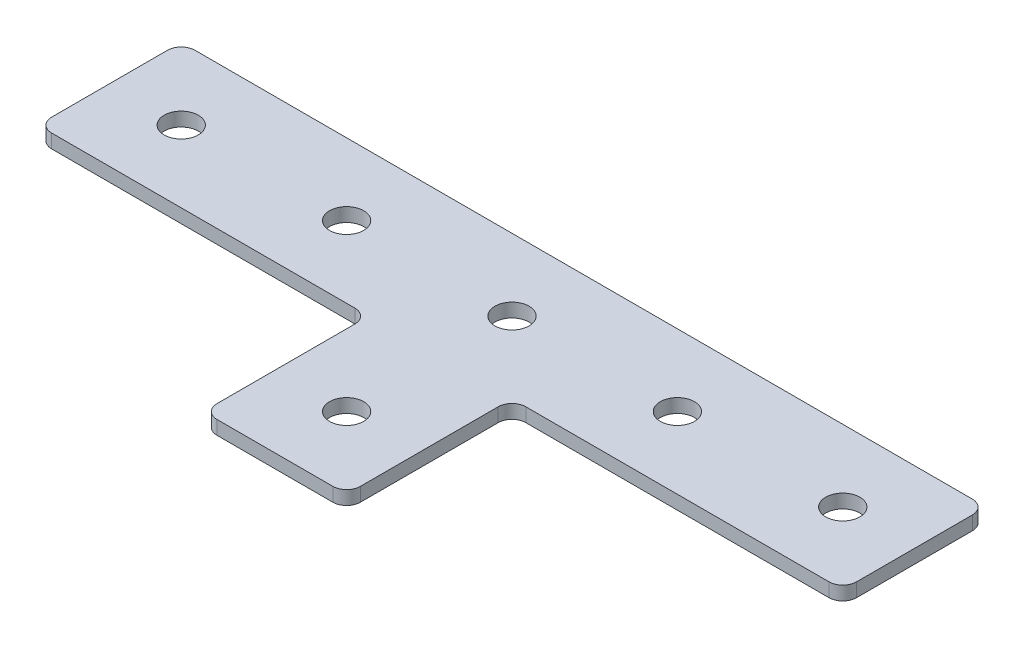
ISO-10303-21;
HEADER;
FILE_DESCRIPTION(('STEP AP214'),'2;1');
FILE_NAME('part.step','',(''),(''),'','','');
FILE_SCHEMA(('AUTOMOTIVE_DESIGN { 1 0 10303 214 1 1 1 1 }'));
ENDSEC;
DATA;
#1=APPLICATION_CONTEXT('core data for automotive mechanical design processes');
#2=APPLICATION_PROTOCOL_DEFINITION('international standard','automotive_design',2000,#1);
#3=PRODUCT_CONTEXT('',#1,'mechanical');
#4=PRODUCT('Part','Part','',(#3));
#5=PRODUCT_RELATED_PRODUCT_CATEGORY('part','',(#4));
#6=PRODUCT_DEFINITION_FORMATION('','',#4);
#7=PRODUCT_DEFINITION_CONTEXT('part definition',#1,'design');
#8=PRODUCT_DEFINITION('design','',#6,#7);
#9=PRODUCT_DEFINITION_SHAPE('','',#8);
#10=(LENGTH_UNIT() NAMED_UNIT(*) SI_UNIT(.MILLI.,.METRE.));
#11=(NAMED_UNIT(*) PLANE_ANGLE_UNIT() SI_UNIT($,.RADIAN.));
#12=(NAMED_UNIT(*) SI_UNIT($,.STERADIAN.) SOLID_ANGLE_UNIT());
#13=UNCERTAINTY_MEASURE_WITH_UNIT(LENGTH_MEASURE(1.E-05),#10,'distance_accuracy_value','');
#14=(GEOMETRIC_REPRESENTATION_CONTEXT(3) GLOBAL_UNCERTAINTY_ASSIGNED_CONTEXT((#13)) GLOBAL_UNIT_ASSIGNED_CONTEXT((#10,
#11,#12)) REPRESENTATION_CONTEXT('',''));
#15=CARTESIAN_POINT('',(0.,0.,0.));
#16=DIRECTION('',(0.,0.,1.));
#17=DIRECTION('',(1.,0.,0.));
#18=AXIS2_PLACEMENT_3D('',#15,#16,#17);
#19=CARTESIAN_POINT('',(-1.7997230439164,1.02470932674123,-15.4746166088125));
#20=DIRECTION('',(0.,-1.,0.));
#21=DIRECTION('',(0.,0.,-1.));
#22=AXIS2_PLACEMENT_3D('',#19,#20,#21);
#23=PLANE('',#22);
#24=CARTESIAN_POINT('',(-1.7997230439164,1.02470932674123,-15.4746166088125));
#25=DIRECTION('',(0.,1.,0.));
#26=DIRECTION('',(0.,0.,1.));
#27=AXIS2_PLACEMENT_3D('',#24,#25,#26);
#28=CIRCLE('',#27,3.1);
#29=CARTESIAN_POINT('',(-1.7997230439164,1.02470932674123,-12.3746166088125));
#30=VERTEX_POINT('',#29);
#31=EDGE_CURVE('E276',#30,#30,#28,.T.);
#32=ORIENTED_EDGE('',*,*,#31,.T.);
#33=EDGE_LOOP('',(#32));
#34=FACE_BOUND('',#33,.T.);
#35=DIRECTION('',(0.,0.,-1.));
#36=VECTOR('',#35,1.);
#37=CARTESIAN_POINT('',(11.2002769560837,1.02470932674123,27.5253833911875));
#38=LINE('',#37,#36);
#39=CARTESIAN_POINT('',(11.2002769560837,1.02470932674123,25.0253833911875));
#40=VERTEX_POINT('',#39);
#41=CARTESIAN_POINT('',(11.2002769560837,1.02470932674123,0.025383391187541));
#42=VERTEX_POINT('',#41);
#43=EDGE_CURVE('E158',#40,#42,#38,.T.);
#44=ORIENTED_EDGE('',*,*,#43,.F.);
#45=CARTESIAN_POINT('',(8.70027695608371,1.02470932674123,25.0253833911875));
#46=DIRECTION('',(0.,-1.,0.));
#47=DIRECTION('',(0.,0.,-1.));
#48=AXIS2_PLACEMENT_3D('',#45,#46,#47);
#49=CIRCLE('',#48,2.5);
#50=CARTESIAN_POINT('',(8.70027695608371,1.02470932674123,27.5253833911875));
#51=VERTEX_POINT('',#50);
#52=EDGE_CURVE('E187',#40,#51,#49,.T.);
#53=ORIENTED_EDGE('',*,*,#52,.T.);
#54=DIRECTION('',(1.,0.,0.));
#55=VECTOR('',#54,1.);
#56=CARTESIAN_POINT('',(-14.7997230439165,1.02470932674123,27.5253833911875));
#57=LINE('',#56,#55);
#58=CARTESIAN_POINT('',(-12.2997230439165,1.02470932674123,27.5253833911875));
#59=VERTEX_POINT('',#58);
#60=EDGE_CURVE('E162',#59,#51,#57,.T.);
#61=ORIENTED_EDGE('',*,*,#60,.F.);
#62=CARTESIAN_POINT('',(-12.2997230439165,1.02470932674123,25.0253833911875));
#63=DIRECTION('',(0.,-1.,0.));
#64=DIRECTION('',(0.,0.,-1.));
#65=AXIS2_PLACEMENT_3D('',#62,#63,#64);
#66=CIRCLE('',#65,2.5);
#67=CARTESIAN_POINT('',(-14.7997230439165,1.02470932674123,25.0253833911875));
#68=VERTEX_POINT('',#67);
#69=EDGE_CURVE('E157',#59,#68,#66,.T.);
#70=ORIENTED_EDGE('',*,*,#69,.T.);
#71=DIRECTION('',(0.,0.,-1.));
#72=VECTOR('',#71,1.);
#73=CARTESIAN_POINT('',(-14.7997230439165,1.02470932674123,27.5253833911875));
#74=LINE('',#73,#72);
#75=CARTESIAN_POINT('',(-14.7997230439165,1.02470932674123,0.0253833911875445));
#76=VERTEX_POINT('',#75);
#77=EDGE_CURVE('E240',#68,#76,#74,.T.);
#78=ORIENTED_EDGE('',*,*,#77,.T.);
#79=CARTESIAN_POINT('',(-17.2997230439165,1.02470932674123,0.0253833911875445));
#80=DIRECTION('',(0.,-1.,0.));
#81=DIRECTION('',(0.,0.,-1.));
#82=AXIS2_PLACEMENT_3D('',#79,#80,#81);
#83=CIRCLE('',#82,2.5);
#84=CARTESIAN_POINT('',(-17.2997230439165,1.02470932674123,-2.47461660881246));
#85=VERTEX_POINT('',#84);
#86=EDGE_CURVE('E10',#76,#85,#83,.F.);
#87=ORIENTED_EDGE('',*,*,#86,.T.);
#88=DIRECTION('',(-1.,0.,0.));
#89=VECTOR('',#88,1.);
#90=CARTESIAN_POINT('',(-14.7997230439165,1.02470932674123,-2.47461660881246));
#91=LINE('',#90,#89);
#92=CARTESIAN_POINT('',(-72.2997230439163,1.02470932674123,-2.47461660881244));
#93=VERTEX_POINT('',#92);
#94=EDGE_CURVE('E230',#85,#93,#91,.T.);
#95=ORIENTED_EDGE('',*,*,#94,.T.);
#96=CARTESIAN_POINT('',(-72.2997230439163,1.02470932674123,-4.97461660881244));
#97=DIRECTION('',(0.,-1.,0.));
#98=DIRECTION('',(0.,0.,-1.));
#99=AXIS2_PLACEMENT_3D('',#96,#97,#98);
#100=CIRCLE('',#99,2.5);
#101=CARTESIAN_POINT('',(-74.7997230439163,1.02470932674123,-4.97461660881244));
#102=VERTEX_POINT('',#101);
#103=EDGE_CURVE('E179',#93,#102,#100,.T.);
#104=ORIENTED_EDGE('',*,*,#103,.T.);
#105=DIRECTION('',(0.,0.,-1.));
#106=VECTOR('',#105,1.);
#107=CARTESIAN_POINT('',(-74.7997230439163,1.02470932674123,-2.47461660881244));
#108=LINE('',#107,#106);
#109=CARTESIAN_POINT('',(-74.7997230439163,1.02470932674123,-25.9746166088125));
#110=VERTEX_POINT('',#109);
#111=EDGE_CURVE('E244',#102,#110,#108,.T.);
#112=ORIENTED_EDGE('',*,*,#111,.T.);
#113=CARTESIAN_POINT('',(-72.2997230439163,1.02470932674123,-25.9746166088125));
#114=DIRECTION('',(0.,-1.,0.));
#115=DIRECTION('',(0.,0.,-1.));
#116=AXIS2_PLACEMENT_3D('',#113,#114,#115);
#117=CIRCLE('',#116,2.5);
#118=CARTESIAN_POINT('',(-72.2997230439163,1.02470932674123,-28.4746166088125));
#119=VERTEX_POINT('',#118);
#120=EDGE_CURVE('E182',#110,#119,#117,.T.);
#121=ORIENTED_EDGE('',*,*,#120,.T.);
#122=DIRECTION('',(-1.,0.,0.));
#123=VECTOR('',#122,1.);
#124=CARTESIAN_POINT('',(71.2002769560835,1.02470932674123,-28.4746166088125));
#125=LINE('',#124,#123);
#126=CARTESIAN_POINT('',(68.7002769560835,1.02470932674123,-28.4746166088125));
#127=VERTEX_POINT('',#126);
#128=EDGE_CURVE('E287',#127,#119,#125,.T.);
#129=ORIENTED_EDGE('',*,*,#128,.F.);
#130=CARTESIAN_POINT('',(68.7002769560835,1.02470932674123,-25.9746166088125));
#131=DIRECTION('',(0.,-1.,0.));
#132=DIRECTION('',(0.,0.,-1.));
#133=AXIS2_PLACEMENT_3D('',#130,#131,#132);
#134=CIRCLE('',#133,2.5);
#135=CARTESIAN_POINT('',(71.2002769560835,1.02470932674123,-25.9746166088125));
#136=VERTEX_POINT('',#135);
#137=EDGE_CURVE('E184',#127,#136,#134,.T.);
#138=ORIENTED_EDGE('',*,*,#137,.T.);
#139=DIRECTION('',(0.,0.,-1.));
#140=VECTOR('',#139,1.);
#141=CARTESIAN_POINT('',(71.2002769560835,1.02470932674123,-2.47461660881246));
#142=LINE('',#141,#140);
#143=CARTESIAN_POINT('',(71.2002769560835,1.02470932674123,-4.97461660881246));
#144=VERTEX_POINT('',#143);
#145=EDGE_CURVE('E284',#144,#136,#142,.T.);
#146=ORIENTED_EDGE('',*,*,#145,.F.);
#147=CARTESIAN_POINT('',(68.7002769560835,1.02470932674123,-4.97461660881246));
#148=DIRECTION('',(0.,-1.,0.));
#149=DIRECTION('',(0.,0.,-1.));
#150=AXIS2_PLACEMENT_3D('',#147,#148,#149);
#151=CIRCLE('',#150,2.5);
#152=CARTESIAN_POINT('',(68.7002769560835,1.02470932674123,-2.47461660881246));
#153=VERTEX_POINT('',#152);
#154=EDGE_CURVE('E31',#144,#153,#151,.T.);
#155=ORIENTED_EDGE('',*,*,#154,.T.);
#156=DIRECTION('',(1.,0.,0.));
#157=VECTOR('',#156,1.);
#158=CARTESIAN_POINT('',(11.2002769560837,1.02470932674123,-2.47461660881246));
#159=LINE('',#158,#157);
#160=CARTESIAN_POINT('',(13.7002769560837,1.02470932674123,-2.47461660881246));
#161=VERTEX_POINT('',#160);
#162=EDGE_CURVE('E282',#161,#153,#159,.T.);
#163=ORIENTED_EDGE('',*,*,#162,.F.);
#164=CARTESIAN_POINT('',(13.7002769560837,1.02470932674123,0.025383391187541));
#165=DIRECTION('',(0.,-1.,0.));
#166=DIRECTION('',(0.,0.,-1.));
#167=AXIS2_PLACEMENT_3D('',#164,#165,#166);
#168=CIRCLE('',#167,2.5);
#169=EDGE_CURVE('E219',#161,#42,#168,.F.);
#170=ORIENTED_EDGE('',*,*,#169,.T.);
#171=EDGE_LOOP('',(#44,#53,#61,#70,#78,#87,#95,#104,#112,#121,#129,#138,#146,#155,#163,#170));
#172=FACE_BOUND('',#171,.T.);
#173=CARTESIAN_POINT('',(-1.79972304391641,1.02470932674123,14.5253833911875));
#174=DIRECTION('',(0.,1.,0.));
#175=DIRECTION('',(0.,0.,1.));
#176=AXIS2_PLACEMENT_3D('',#173,#174,#175);
#177=CIRCLE('',#176,3.1);
#178=CARTESIAN_POINT('',(-1.79972304391641,1.02470932674123,17.6253833911875));
#179=VERTEX_POINT('',#178);
#180=EDGE_CURVE('E264',#179,#179,#177,.T.);
#181=ORIENTED_EDGE('',*,*,#180,.T.);
#182=EDGE_LOOP('',(#181));
#183=FACE_BOUND('',#182,.T.);
#184=CARTESIAN_POINT('',(58.2002769560836,1.02470932674123,-15.4746166088125));
#185=DIRECTION('',(0.,1.,0.));
#186=DIRECTION('',(0.,0.,1.));
#187=AXIS2_PLACEMENT_3D('',#184,#185,#186);
#188=CIRCLE('',#187,3.1);
#189=CARTESIAN_POINT('',(58.2002769560836,1.02470932674123,-12.3746166088125));
#190=VERTEX_POINT('',#189);
#191=EDGE_CURVE('E258',#190,#190,#188,.T.);
#192=ORIENTED_EDGE('',*,*,#191,.T.);
#193=EDGE_LOOP('',(#192));
#194=FACE_BOUND('',#193,.T.);
#195=CARTESIAN_POINT('',(28.2002769560836,1.02470932674123,-15.4746166088125));
#196=DIRECTION('',(0.,1.,0.));
#197=DIRECTION('',(0.,0.,1.));
#198=AXIS2_PLACEMENT_3D('',#195,#196,#197);
#199=CIRCLE('',#198,3.1);
#200=CARTESIAN_POINT('',(28.2002769560836,1.02470932674123,-12.3746166088125));
#201=VERTEX_POINT('',#200);
#202=EDGE_CURVE('E270',#201,#201,#199,.T.);
#203=ORIENTED_EDGE('',*,*,#202,.T.);
#204=EDGE_LOOP('',(#203));
#205=FACE_BOUND('',#204,.T.);
#206=CARTESIAN_POINT('',(-61.7997230439164,1.02470932674123,-15.4746166088125));
#207=DIRECTION('',(0.,-1.,0.));
#208=DIRECTION('',(0.,0.,1.));
#209=AXIS2_PLACEMENT_3D('',#206,#207,#208);
#210=CIRCLE('',#209,3.1);
#211=CARTESIAN_POINT('',(-61.7997230439164,1.02470932674123,-12.3746166088125));
#212=VERTEX_POINT('',#211);
#213=EDGE_CURVE('E393',#212,#212,#210,.T.);
#214=ORIENTED_EDGE('',*,*,#213,.F.);
#215=EDGE_LOOP('',(#214));
#216=FACE_BOUND('',#215,.T.);
#217=CARTESIAN_POINT('',(-31.7997230439164,1.02470932674123,-15.4746166088125));
#218=DIRECTION('',(0.,-1.,0.));
#219=DIRECTION('',(0.,0.,1.));
#220=AXIS2_PLACEMENT_3D('',#217,#218,#219);
#221=CIRCLE('',#220,3.1);
#222=CARTESIAN_POINT('',(-31.7997230439164,1.02470932674123,-12.3746166088125));
#223=VERTEX_POINT('',#222);
#224=EDGE_CURVE('E255',#223,#223,#221,.T.);
#225=ORIENTED_EDGE('',*,*,#224,.F.);
#226=EDGE_LOOP('',(#225));
#227=FACE_BOUND('',#226,.T.);
#228=ADVANCED_FACE('F16',(#34,#172,#183,#194,#205,#216,#227),#23,.T.);
#229=CARTESIAN_POINT('',(11.2002769560837,1.02470932674123,-2.47461660881246));
#230=DIRECTION('',(0.,0.,1.));
#231=DIRECTION('',(1.,0.,0.));
#232=AXIS2_PLACEMENT_3D('',#229,#230,#231);
#233=PLANE('',#232);
#234=DIRECTION('',(1.,0.,0.));
#235=VECTOR('',#234,1.);
#236=CARTESIAN_POINT('',(11.2002769560837,3.52470932674123,-2.47461660881246));
#237=LINE('',#236,#235);
#238=CARTESIAN_POINT('',(13.7002769560837,3.52470932674123,-2.47461660881246));
#239=VERTEX_POINT('',#238);
#240=CARTESIAN_POINT('',(68.7002769560835,3.52470932674123,-2.47461660881246));
#241=VERTEX_POINT('',#240);
#242=EDGE_CURVE('E279',#239,#241,#237,.T.);
#243=ORIENTED_EDGE('',*,*,#242,.F.);
#244=DIRECTION('',(0.,1.,0.));
#245=VECTOR('',#244,1.);
#246=CARTESIAN_POINT('',(13.7002769560837,1.02470932674123,-2.47461660881246));
#247=LINE('',#246,#245);
#248=EDGE_CURVE('E38',#239,#161,#247,.F.);
#249=ORIENTED_EDGE('',*,*,#248,.T.);
#250=ORIENTED_EDGE('',*,*,#162,.T.);
#251=DIRECTION('',(0.,1.,0.));
#252=VECTOR('',#251,1.);
#253=CARTESIAN_POINT('',(68.7002769560835,1.02470932674123,-2.47461660881246));
#254=LINE('',#253,#252);
#255=EDGE_CURVE('E189',#153,#241,#254,.T.);
#256=ORIENTED_EDGE('',*,*,#255,.T.);
#257=EDGE_LOOP('',(#243,#249,#250,#256));
#258=FACE_BOUND('',#257,.T.);
#259=ADVANCED_FACE('F315',(#258),#233,.T.);
#260=CARTESIAN_POINT('',(11.2002769560837,1.02470932674123,27.5253833911875));
#261=DIRECTION('',(1.,0.,0.));
#262=DIRECTION('',(0.,0.,-1.));
#263=AXIS2_PLACEMENT_3D('',#260,#261,#262);
#264=PLANE('',#263);
#265=DIRECTION('',(0.,0.,-1.));
#266=VECTOR('',#265,1.);
#267=CARTESIAN_POINT('',(11.2002769560837,3.52470932674123,27.5253833911875));
#268=LINE('',#267,#266);
#269=CARTESIAN_POINT('',(11.2002769560837,3.52470932674123,25.0253833911875));
#270=VERTEX_POINT('',#269);
#271=CARTESIAN_POINT('',(11.2002769560837,3.52470932674123,0.025383391187541));
#272=VERTEX_POINT('',#271);
#273=EDGE_CURVE('E152',#270,#272,#268,.T.);
#274=ORIENTED_EDGE('',*,*,#273,.F.);
#275=DIRECTION('',(0.,1.,0.));
#276=VECTOR('',#275,1.);
#277=CARTESIAN_POINT('',(11.2002769560837,1.02470932674123,25.0253833911875));
#278=LINE('',#277,#276);
#279=EDGE_CURVE('E177',#270,#40,#278,.F.);
#280=ORIENTED_EDGE('',*,*,#279,.T.);
#281=ORIENTED_EDGE('',*,*,#43,.T.);
#282=DIRECTION('',(0.,1.,0.));
#283=VECTOR('',#282,1.);
#284=CARTESIAN_POINT('',(11.2002769560837,3.52470932674123,0.025383391187541));
#285=LINE('',#284,#283);
#286=EDGE_CURVE('E174',#42,#272,#285,.T.);
#287=ORIENTED_EDGE('',*,*,#286,.T.);
#288=EDGE_LOOP('',(#274,#280,#281,#287));
#289=FACE_BOUND('',#288,.T.);
#290=ADVANCED_FACE('F323',(#289),#264,.T.);
#291=CARTESIAN_POINT('',(-14.7997230439165,1.02470932674123,27.5253833911875));
#292=DIRECTION('',(0.,0.,1.));
#293=DIRECTION('',(1.,0.,0.));
#294=AXIS2_PLACEMENT_3D('',#291,#292,#293);
#295=PLANE('',#294);
#296=ORIENTED_EDGE('',*,*,#60,.T.);
#297=DIRECTION('',(0.,1.,0.));
#298=VECTOR('',#297,1.);
#299=CARTESIAN_POINT('',(8.70027695608371,1.02470932674123,27.5253833911875));
#300=LINE('',#299,#298);
#301=CARTESIAN_POINT('',(8.70027695608371,3.52470932674123,27.5253833911875));
#302=VERTEX_POINT('',#301);
#303=EDGE_CURVE('E151',#51,#302,#300,.T.);
#304=ORIENTED_EDGE('',*,*,#303,.T.);
#305=DIRECTION('',(1.,0.,0.));
#306=VECTOR('',#305,1.);
#307=CARTESIAN_POINT('',(-14.7997230439165,3.52470932674123,27.5253833911875));
#308=LINE('',#307,#306);
#309=CARTESIAN_POINT('',(-12.2997230439165,3.52470932674123,27.5253833911875));
#310=VERTEX_POINT('',#309);
#311=EDGE_CURVE('E134',#310,#302,#308,.T.);
#312=ORIENTED_EDGE('',*,*,#311,.F.);
#313=DIRECTION('',(0.,1.,0.));
#314=VECTOR('',#313,1.);
#315=CARTESIAN_POINT('',(-12.2997230439165,1.02470932674123,27.5253833911875));
#316=LINE('',#315,#314);
#317=EDGE_CURVE('E148',#310,#59,#316,.F.);
#318=ORIENTED_EDGE('',*,*,#317,.T.);
#319=EDGE_LOOP('',(#296,#304,#312,#318));
#320=FACE_BOUND('',#319,.T.);
#321=ADVANCED_FACE('F147',(#320),#295,.T.);
#322=CARTESIAN_POINT('',(71.2002769560835,1.02470932674123,-28.4746166088125));
#323=DIRECTION('',(0.,0.,-1.));
#324=DIRECTION('',(-1.,0.,0.));
#325=AXIS2_PLACEMENT_3D('',#322,#323,#324);
#326=PLANE('',#325);
#327=DIRECTION('',(-1.,0.,0.));
#328=VECTOR('',#327,1.);
#329=CARTESIAN_POINT('',(71.2002769560835,3.52470932674123,-28.4746166088125));
#330=LINE('',#329,#328);
#331=CARTESIAN_POINT('',(68.7002769560835,3.52470932674123,-28.4746166088125));
#332=VERTEX_POINT('',#331);
#333=CARTESIAN_POINT('',(-72.2997230439163,3.52470932674123,-28.4746166088125));
#334=VERTEX_POINT('',#333);
#335=EDGE_CURVE('E153',#332,#334,#330,.T.);
#336=ORIENTED_EDGE('',*,*,#335,.F.);
#337=DIRECTION('',(0.,1.,0.));
#338=VECTOR('',#337,1.);
#339=CARTESIAN_POINT('',(68.7002769560835,1.02470932674123,-28.4746166088125));
#340=LINE('',#339,#338);
#341=EDGE_CURVE('E201',#332,#127,#340,.F.);
#342=ORIENTED_EDGE('',*,*,#341,.T.);
#343=ORIENTED_EDGE('',*,*,#128,.T.);
#344=DIRECTION('',(0.,1.,0.));
#345=VECTOR('',#344,1.);
#346=CARTESIAN_POINT('',(-72.2997230439163,1.02470932674123,-28.4746166088125));
#347=LINE('',#346,#345);
#348=EDGE_CURVE('E198',#119,#334,#347,.T.);
#349=ORIENTED_EDGE('',*,*,#348,.T.);
#350=EDGE_LOOP('',(#336,#342,#343,#349));
#351=FACE_BOUND('',#350,.T.);
#352=ADVANCED_FACE('F301',(#351),#326,.T.);
#353=CARTESIAN_POINT('',(71.2002769560835,1.02470932674123,-2.47461660881246));
#354=DIRECTION('',(1.,0.,0.));
#355=DIRECTION('',(0.,0.,-1.));
#356=AXIS2_PLACEMENT_3D('',#353,#354,#355);
#357=PLANE('',#356);
#358=DIRECTION('',(0.,0.,-1.));
#359=VECTOR('',#358,1.);
#360=CARTESIAN_POINT('',(71.2002769560835,3.52470932674123,-2.47461660881246));
#361=LINE('',#360,#359);
#362=CARTESIAN_POINT('',(71.2002769560835,3.52470932674123,-4.97461660881246));
#363=VERTEX_POINT('',#362);
#364=CARTESIAN_POINT('',(71.2002769560835,3.52470932674123,-25.9746166088125));
#365=VERTEX_POINT('',#364);
#366=EDGE_CURVE('E293',#363,#365,#361,.T.);
#367=ORIENTED_EDGE('',*,*,#366,.F.);
#368=DIRECTION('',(0.,1.,0.));
#369=VECTOR('',#368,1.);
#370=CARTESIAN_POINT('',(71.2002769560835,1.02470932674123,-4.97461660881246));
#371=LINE('',#370,#369);
#372=EDGE_CURVE('E196',#363,#144,#371,.F.);
#373=ORIENTED_EDGE('',*,*,#372,.T.);
#374=ORIENTED_EDGE('',*,*,#145,.T.);
#375=DIRECTION('',(0.,1.,0.));
#376=VECTOR('',#375,1.);
#377=CARTESIAN_POINT('',(71.2002769560835,1.02470932674123,-25.9746166088125));
#378=LINE('',#377,#376);
#379=EDGE_CURVE('E193',#136,#365,#378,.T.);
#380=ORIENTED_EDGE('',*,*,#379,.T.);
#381=EDGE_LOOP('',(#367,#373,#374,#380));
#382=FACE_BOUND('',#381,.T.);
#383=ADVANCED_FACE('F310',(#382),#357,.T.);
#384=CARTESIAN_POINT('',(-1.7997230439164,3.52470932674123,-15.4746166088125));
#385=DIRECTION('',(0.,-1.,0.));
#386=DIRECTION('',(0.,0.,-1.));
#387=AXIS2_PLACEMENT_3D('',#384,#385,#386);
#388=PLANE('',#387);
#389=CARTESIAN_POINT('',(-1.7997230439164,3.52470932674123,-15.4746166088125));
#390=DIRECTION('',(0.,1.,0.));
#391=DIRECTION('',(0.,0.,1.));
#392=AXIS2_PLACEMENT_3D('',#389,#390,#391);
#393=CIRCLE('',#392,3.1);
#394=CARTESIAN_POINT('',(-1.7997230439164,3.52470932674123,-12.3746166088125));
#395=VERTEX_POINT('',#394);
#396=EDGE_CURVE('E273',#395,#395,#393,.T.);
#397=ORIENTED_EDGE('',*,*,#396,.F.);
#398=EDGE_LOOP('',(#397));
#399=FACE_BOUND('',#398,.T.);
#400=ORIENTED_EDGE('',*,*,#311,.T.);
#401=CARTESIAN_POINT('',(8.70027695608371,3.52470932674123,25.0253833911875));
#402=DIRECTION('',(0.,-1.,0.));
#403=DIRECTION('',(0.,0.,-1.));
#404=AXIS2_PLACEMENT_3D('',#401,#402,#403);
#405=CIRCLE('',#404,2.5);
#406=EDGE_CURVE('E172',#302,#270,#405,.F.);
#407=ORIENTED_EDGE('',*,*,#406,.T.);
#408=ORIENTED_EDGE('',*,*,#273,.T.);
#409=CARTESIAN_POINT('',(13.7002769560837,3.52470932674123,0.025383391187541));
#410=DIRECTION('',(0.,-1.,0.));
#411=DIRECTION('',(0.,0.,-1.));
#412=AXIS2_PLACEMENT_3D('',#409,#410,#411);
#413=CIRCLE('',#412,2.5);
#414=EDGE_CURVE('E217',#272,#239,#413,.T.);
#415=ORIENTED_EDGE('',*,*,#414,.T.);
#416=ORIENTED_EDGE('',*,*,#242,.T.);
#417=CARTESIAN_POINT('',(68.7002769560835,3.52470932674123,-4.97461660881246));
#418=DIRECTION('',(0.,-1.,0.));
#419=DIRECTION('',(0.,0.,-1.));
#420=AXIS2_PLACEMENT_3D('',#417,#418,#419);
#421=CIRCLE('',#420,2.5);
#422=EDGE_CURVE('E170',#241,#363,#421,.F.);
#423=ORIENTED_EDGE('',*,*,#422,.T.);
#424=ORIENTED_EDGE('',*,*,#366,.T.);
#425=CARTESIAN_POINT('',(68.7002769560835,3.52470932674123,-25.9746166088125));
#426=DIRECTION('',(0.,-1.,0.));
#427=DIRECTION('',(0.,0.,-1.));
#428=AXIS2_PLACEMENT_3D('',#425,#426,#427);
#429=CIRCLE('',#428,2.5);
#430=EDGE_CURVE('E168',#365,#332,#429,.F.);
#431=ORIENTED_EDGE('',*,*,#430,.T.);
#432=ORIENTED_EDGE('',*,*,#335,.T.);
#433=CARTESIAN_POINT('',(-72.2997230439163,3.52470932674123,-25.9746166088125));
#434=DIRECTION('',(0.,-1.,0.));
#435=DIRECTION('',(0.,0.,-1.));
#436=AXIS2_PLACEMENT_3D('',#433,#434,#435);
#437=CIRCLE('',#436,2.5);
#438=CARTESIAN_POINT('',(-74.7997230439163,3.52470932674123,-25.9746166088125));
#439=VERTEX_POINT('',#438);
#440=EDGE_CURVE('E141',#334,#439,#437,.F.);
#441=ORIENTED_EDGE('',*,*,#440,.T.);
#442=DIRECTION('',(0.,0.,-1.));
#443=VECTOR('',#442,1.);
#444=CARTESIAN_POINT('',(-74.7997230439163,3.52470932674123,-2.47461660881244));
#445=LINE('',#444,#443);
#446=CARTESIAN_POINT('',(-74.7997230439163,3.52470932674123,-4.97461660881244));
#447=VERTEX_POINT('',#446);
#448=EDGE_CURVE('E231',#447,#439,#445,.T.);
#449=ORIENTED_EDGE('',*,*,#448,.F.);
#450=CARTESIAN_POINT('',(-72.2997230439163,3.52470932674123,-4.97461660881244));
#451=DIRECTION('',(0.,-1.,0.));
#452=DIRECTION('',(0.,0.,-1.));
#453=AXIS2_PLACEMENT_3D('',#450,#451,#452);
#454=CIRCLE('',#453,2.5);
#455=CARTESIAN_POINT('',(-72.2997230439163,3.52470932674123,-2.47461660881244));
#456=VERTEX_POINT('',#455);
#457=EDGE_CURVE('E142',#447,#456,#454,.F.);
#458=ORIENTED_EDGE('',*,*,#457,.T.);
#459=DIRECTION('',(-1.,0.,0.));
#460=VECTOR('',#459,1.);
#461=CARTESIAN_POINT('',(-14.7997230439165,3.52470932674123,-2.47461660881246));
#462=LINE('',#461,#460);
#463=CARTESIAN_POINT('',(-17.2997230439165,3.52470932674123,-2.47461660881246));
#464=VERTEX_POINT('',#463);
#465=EDGE_CURVE('E222',#464,#456,#462,.T.);
#466=ORIENTED_EDGE('',*,*,#465,.F.);
#467=CARTESIAN_POINT('',(-17.2997230439165,3.52470932674123,0.0253833911875445));
#468=DIRECTION('',(0.,-1.,0.));
#469=DIRECTION('',(0.,0.,-1.));
#470=AXIS2_PLACEMENT_3D('',#467,#468,#469);
#471=CIRCLE('',#470,2.5);
#472=CARTESIAN_POINT('',(-14.7997230439165,3.52470932674123,0.0253833911875445));
#473=VERTEX_POINT('',#472);
#474=EDGE_CURVE('E24',#464,#473,#471,.T.);
#475=ORIENTED_EDGE('',*,*,#474,.T.);
#476=DIRECTION('',(0.,0.,-1.));
#477=VECTOR('',#476,1.);
#478=CARTESIAN_POINT('',(-14.7997230439165,3.52470932674123,27.5253833911875));
#479=LINE('',#478,#477);
#480=CARTESIAN_POINT('',(-14.7997230439165,3.52470932674123,25.0253833911875));
#481=VERTEX_POINT('',#480);
#482=EDGE_CURVE('E136',#481,#473,#479,.T.);
#483=ORIENTED_EDGE('',*,*,#482,.F.);
#484=CARTESIAN_POINT('',(-12.2997230439165,3.52470932674123,25.0253833911875));
#485=DIRECTION('',(0.,-1.,0.));
#486=DIRECTION('',(0.,0.,-1.));
#487=AXIS2_PLACEMENT_3D('',#484,#485,#486);
#488=CIRCLE('',#487,2.5);
#489=EDGE_CURVE('E130',#481,#310,#488,.F.);
#490=ORIENTED_EDGE('',*,*,#489,.T.);
#491=EDGE_LOOP('',(#400,#407,#408,#415,#416,#423,#424,#431,#432,#441,#449,#458,#466,#475,#483,#490));
#492=FACE_BOUND('',#491,.T.);
#493=CARTESIAN_POINT('',(58.2002769560836,3.52470932674123,-15.4746166088125));
#494=DIRECTION('',(0.,1.,0.));
#495=DIRECTION('',(0.,0.,1.));
#496=AXIS2_PLACEMENT_3D('',#493,#494,#495);
#497=CIRCLE('',#496,3.1);
#498=CARTESIAN_POINT('',(58.2002769560836,3.52470932674123,-12.3746166088125));
#499=VERTEX_POINT('',#498);
#500=EDGE_CURVE('E253',#499,#499,#497,.T.);
#501=ORIENTED_EDGE('',*,*,#500,.F.);
#502=EDGE_LOOP('',(#501));
#503=FACE_BOUND('',#502,.T.);
#504=CARTESIAN_POINT('',(28.2002769560836,3.52470932674123,-15.4746166088125));
#505=DIRECTION('',(0.,1.,0.));
#506=DIRECTION('',(0.,0.,1.));
#507=AXIS2_PLACEMENT_3D('',#504,#505,#506);
#508=CIRCLE('',#507,3.1);
#509=CARTESIAN_POINT('',(28.2002769560836,3.52470932674123,-12.3746166088125));
#510=VERTEX_POINT('',#509);
#511=EDGE_CURVE('E267',#510,#510,#508,.T.);
#512=ORIENTED_EDGE('',*,*,#511,.F.);
#513=EDGE_LOOP('',(#512));
#514=FACE_BOUND('',#513,.T.);
#515=CARTESIAN_POINT('',(-1.79972304391641,3.52470932674123,14.5253833911875));
#516=DIRECTION('',(0.,1.,0.));
#517=DIRECTION('',(0.,0.,1.));
#518=AXIS2_PLACEMENT_3D('',#515,#516,#517);
#519=CIRCLE('',#518,3.1);
#520=CARTESIAN_POINT('',(-1.79972304391641,3.52470932674123,17.6253833911875));
#521=VERTEX_POINT('',#520);
#522=EDGE_CURVE('E261',#521,#521,#519,.T.);
#523=ORIENTED_EDGE('',*,*,#522,.F.);
#524=EDGE_LOOP('',(#523));
#525=FACE_BOUND('',#524,.T.);
#526=CARTESIAN_POINT('',(-61.7997230439164,3.52470932674123,-15.4746166088125));
#527=DIRECTION('',(0.,-1.,0.));
#528=DIRECTION('',(0.,0.,1.));
#529=AXIS2_PLACEMENT_3D('',#526,#527,#528);
#530=CIRCLE('',#529,3.1);
#531=CARTESIAN_POINT('',(-61.7997230439164,3.52470932674123,-12.3746166088125));
#532=VERTEX_POINT('',#531);
#533=EDGE_CURVE('E395',#532,#532,#530,.T.);
#534=ORIENTED_EDGE('',*,*,#533,.T.);
#535=EDGE_LOOP('',(#534));
#536=FACE_BOUND('',#535,.T.);
#537=CARTESIAN_POINT('',(-31.7997230439164,3.52470932674123,-15.4746166088125));
#538=DIRECTION('',(0.,-1.,0.));
#539=DIRECTION('',(0.,0.,1.));
#540=AXIS2_PLACEMENT_3D('',#537,#538,#539);
#541=CIRCLE('',#540,3.1);
#542=CARTESIAN_POINT('',(-31.7997230439164,3.52470932674123,-12.3746166088125));
#543=VERTEX_POINT('',#542);
#544=EDGE_CURVE('E249',#543,#543,#541,.T.);
#545=ORIENTED_EDGE('',*,*,#544,.T.);
#546=EDGE_LOOP('',(#545));
#547=FACE_BOUND('',#546,.T.);
#548=ADVANCED_FACE('F132',(#399,#492,#503,#514,#525,#536,#547),#388,.F.);
#549=CARTESIAN_POINT('',(-1.7997230439164,1.02470932674123,-15.4746166088125));
#550=DIRECTION('',(0.,1.,0.));
#551=DIRECTION('',(0.,0.,1.));
#552=AXIS2_PLACEMENT_3D('',#549,#550,#551);
#553=CYLINDRICAL_SURFACE('',#552,3.1);
#554=ORIENTED_EDGE('',*,*,#31,.F.);
#555=EDGE_LOOP('',(#554));
#556=FACE_BOUND('',#555,.T.);
#557=ORIENTED_EDGE('',*,*,#396,.T.);
#558=EDGE_LOOP('',(#557));
#559=FACE_BOUND('',#558,.T.);
#560=ADVANCED_FACE('F349',(#556,#559),#553,.F.);
#561=CARTESIAN_POINT('',(28.2002769560836,1.02470932674123,-15.4746166088125));
#562=DIRECTION('',(0.,1.,0.));
#563=DIRECTION('',(0.,0.,1.));
#564=AXIS2_PLACEMENT_3D('',#561,#562,#563);
#565=CYLINDRICAL_SURFACE('',#564,3.1);
#566=ORIENTED_EDGE('',*,*,#202,.F.);
#567=EDGE_LOOP('',(#566));
#568=FACE_BOUND('',#567,.T.);
#569=ORIENTED_EDGE('',*,*,#511,.T.);
#570=EDGE_LOOP('',(#569));
#571=FACE_BOUND('',#570,.T.);
#572=ADVANCED_FACE('F362',(#568,#571),#565,.F.);
#573=CARTESIAN_POINT('',(-1.79972304391641,1.02470932674123,14.5253833911875));
#574=DIRECTION('',(0.,1.,0.));
#575=DIRECTION('',(0.,0.,1.));
#576=AXIS2_PLACEMENT_3D('',#573,#574,#575);
#577=CYLINDRICAL_SURFACE('',#576,3.1);
#578=ORIENTED_EDGE('',*,*,#522,.T.);
#579=EDGE_LOOP('',(#578));
#580=FACE_BOUND('',#579,.T.);
#581=ORIENTED_EDGE('',*,*,#180,.F.);
#582=EDGE_LOOP('',(#581));
#583=FACE_BOUND('',#582,.T.);
#584=ADVANCED_FACE('F366',(#580,#583),#577,.F.);
#585=CARTESIAN_POINT('',(58.2002769560836,1.02470932674123,-15.4746166088125));
#586=DIRECTION('',(0.,1.,0.));
#587=DIRECTION('',(0.,0.,1.));
#588=AXIS2_PLACEMENT_3D('',#585,#586,#587);
#589=CYLINDRICAL_SURFACE('',#588,3.1);
#590=ORIENTED_EDGE('',*,*,#191,.F.);
#591=EDGE_LOOP('',(#590));
#592=FACE_BOUND('',#591,.T.);
#593=ORIENTED_EDGE('',*,*,#500,.T.);
#594=EDGE_LOOP('',(#593));
#595=FACE_BOUND('',#594,.T.);
#596=ADVANCED_FACE('F370',(#592,#595),#589,.F.);
#597=CARTESIAN_POINT('',(-14.7997230439165,1.02470932674123,-2.47461660881246));
#598=DIRECTION('',(0.,0.,1.));
#599=DIRECTION('',(-1.,0.,0.));
#600=AXIS2_PLACEMENT_3D('',#597,#598,#599);
#601=PLANE('',#600);
#602=ORIENTED_EDGE('',*,*,#94,.F.);
#603=DIRECTION('',(0.,1.,0.));
#604=VECTOR('',#603,1.);
#605=CARTESIAN_POINT('',(-17.2997230439165,3.52470932674123,-2.47461660881246));
#606=LINE('',#605,#604);
#607=EDGE_CURVE('E210',#85,#464,#606,.T.);
#608=ORIENTED_EDGE('',*,*,#607,.T.);
#609=ORIENTED_EDGE('',*,*,#465,.T.);
#610=DIRECTION('',(0.,1.,0.));
#611=VECTOR('',#610,1.);
#612=CARTESIAN_POINT('',(-72.2997230439163,1.02470932674123,-2.47461660881244));
#613=LINE('',#612,#611);
#614=EDGE_CURVE('E208',#456,#93,#613,.F.);
#615=ORIENTED_EDGE('',*,*,#614,.T.);
#616=EDGE_LOOP('',(#602,#608,#609,#615));
#617=FACE_BOUND('',#616,.T.);
#618=ADVANCED_FACE('F242',(#617),#601,.T.);
#619=CARTESIAN_POINT('',(-14.7997230439165,1.02470932674123,27.5253833911875));
#620=DIRECTION('',(-1.,0.,0.));
#621=DIRECTION('',(0.,0.,-1.));
#622=AXIS2_PLACEMENT_3D('',#619,#620,#621);
#623=PLANE('',#622);
#624=ORIENTED_EDGE('',*,*,#482,.T.);
#625=DIRECTION('',(0.,1.,0.));
#626=VECTOR('',#625,1.);
#627=CARTESIAN_POINT('',(-14.7997230439165,1.02470932674123,0.0253833911875445));
#628=LINE('',#627,#626);
#629=EDGE_CURVE('E215',#473,#76,#628,.F.);
#630=ORIENTED_EDGE('',*,*,#629,.T.);
#631=ORIENTED_EDGE('',*,*,#77,.F.);
#632=DIRECTION('',(0.,1.,0.));
#633=VECTOR('',#632,1.);
#634=CARTESIAN_POINT('',(-14.7997230439165,1.02470932674123,25.0253833911875));
#635=LINE('',#634,#633);
#636=EDGE_CURVE('E213',#68,#481,#635,.T.);
#637=ORIENTED_EDGE('',*,*,#636,.T.);
#638=EDGE_LOOP('',(#624,#630,#631,#637));
#639=FACE_BOUND('',#638,.T.);
#640=ADVANCED_FACE('F227',(#639),#623,.T.);
#641=CARTESIAN_POINT('',(-74.7997230439163,1.02470932674123,-2.47461660881244));
#642=DIRECTION('',(-1.,0.,0.));
#643=DIRECTION('',(0.,0.,-1.));
#644=AXIS2_PLACEMENT_3D('',#641,#642,#643);
#645=PLANE('',#644);
#646=ORIENTED_EDGE('',*,*,#448,.T.);
#647=DIRECTION('',(0.,1.,0.));
#648=VECTOR('',#647,1.);
#649=CARTESIAN_POINT('',(-74.7997230439163,1.02470932674123,-25.9746166088125));
#650=LINE('',#649,#648);
#651=EDGE_CURVE('E206',#439,#110,#650,.F.);
#652=ORIENTED_EDGE('',*,*,#651,.T.);
#653=ORIENTED_EDGE('',*,*,#111,.F.);
#654=DIRECTION('',(0.,1.,0.));
#655=VECTOR('',#654,1.);
#656=CARTESIAN_POINT('',(-74.7997230439163,1.02470932674123,-4.97461660881244));
#657=LINE('',#656,#655);
#658=EDGE_CURVE('E203',#102,#447,#657,.T.);
#659=ORIENTED_EDGE('',*,*,#658,.T.);
#660=EDGE_LOOP('',(#646,#652,#653,#659));
#661=FACE_BOUND('',#660,.T.);
#662=ADVANCED_FACE('F377',(#661),#645,.T.);
#663=CARTESIAN_POINT('',(-31.7997230439164,1.02470932674123,-15.4746166088125));
#664=DIRECTION('',(0.,1.,0.));
#665=DIRECTION('',(0.,0.,1.));
#666=AXIS2_PLACEMENT_3D('',#663,#664,#665);
#667=CYLINDRICAL_SURFACE('',#666,3.1);
#668=ORIENTED_EDGE('',*,*,#224,.T.);
#669=EDGE_LOOP('',(#668));
#670=FACE_BOUND('',#669,.T.);
#671=ORIENTED_EDGE('',*,*,#544,.F.);
#672=EDGE_LOOP('',(#671));
#673=FACE_BOUND('',#672,.T.);
#674=ADVANCED_FACE('F337',(#670,#673),#667,.F.);
#675=CARTESIAN_POINT('',(-61.7997230439164,1.02470932674123,-15.4746166088125));
#676=DIRECTION('',(0.,1.,0.));
#677=DIRECTION('',(0.,0.,1.));
#678=AXIS2_PLACEMENT_3D('',#675,#676,#677);
#679=CYLINDRICAL_SURFACE('',#678,3.1);
#680=ORIENTED_EDGE('',*,*,#213,.T.);
#681=EDGE_LOOP('',(#680));
#682=FACE_BOUND('',#681,.T.);
#683=ORIENTED_EDGE('',*,*,#533,.F.);
#684=EDGE_LOOP('',(#683));
#685=FACE_BOUND('',#684,.T.);
#686=ADVANCED_FACE('F329',(#682,#685),#679,.F.);
#687=CARTESIAN_POINT('',(8.70027695608371,1.02470932674123,25.0253833911875));
#688=DIRECTION('',(0.,1.,0.));
#689=DIRECTION('',(0.,0.,1.));
#690=AXIS2_PLACEMENT_3D('',#687,#688,#689);
#691=CYLINDRICAL_SURFACE('',#690,2.5);
#692=ORIENTED_EDGE('',*,*,#52,.F.);
#693=ORIENTED_EDGE('',*,*,#279,.F.);
#694=ORIENTED_EDGE('',*,*,#406,.F.);
#695=ORIENTED_EDGE('',*,*,#303,.F.);
#696=EDGE_LOOP('',(#692,#693,#694,#695));
#697=FACE_BOUND('',#696,.T.);
#698=ADVANCED_FACE('F327',(#697),#691,.T.);
#699=CARTESIAN_POINT('',(13.7002769560837,1.02470932674123,0.025383391187541));
#700=DIRECTION('',(0.,-1.,0.));
#701=DIRECTION('',(0.,0.,-1.));
#702=AXIS2_PLACEMENT_3D('',#699,#700,#701);
#703=CYLINDRICAL_SURFACE('',#702,2.5);
#704=ORIENTED_EDGE('',*,*,#169,.F.);
#705=ORIENTED_EDGE('',*,*,#248,.F.);
#706=ORIENTED_EDGE('',*,*,#414,.F.);
#707=ORIENTED_EDGE('',*,*,#286,.F.);
#708=EDGE_LOOP('',(#704,#705,#706,#707));
#709=FACE_BOUND('',#708,.T.);
#710=ADVANCED_FACE('F321',(#709),#703,.F.);
#711=CARTESIAN_POINT('',(68.7002769560835,1.02470932674123,-4.97461660881246));
#712=DIRECTION('',(0.,1.,0.));
#713=DIRECTION('',(0.,0.,1.));
#714=AXIS2_PLACEMENT_3D('',#711,#712,#713);
#715=CYLINDRICAL_SURFACE('',#714,2.5);
#716=ORIENTED_EDGE('',*,*,#154,.F.);
#717=ORIENTED_EDGE('',*,*,#372,.F.);
#718=ORIENTED_EDGE('',*,*,#422,.F.);
#719=ORIENTED_EDGE('',*,*,#255,.F.);
#720=EDGE_LOOP('',(#716,#717,#718,#719));
#721=FACE_BOUND('',#720,.T.);
#722=ADVANCED_FACE('F313',(#721),#715,.T.);
#723=CARTESIAN_POINT('',(68.7002769560835,1.02470932674123,-25.9746166088125));
#724=DIRECTION('',(0.,1.,0.));
#725=DIRECTION('',(0.,0.,1.));
#726=AXIS2_PLACEMENT_3D('',#723,#724,#725);
#727=CYLINDRICAL_SURFACE('',#726,2.5);
#728=ORIENTED_EDGE('',*,*,#137,.F.);
#729=ORIENTED_EDGE('',*,*,#341,.F.);
#730=ORIENTED_EDGE('',*,*,#430,.F.);
#731=ORIENTED_EDGE('',*,*,#379,.F.);
#732=EDGE_LOOP('',(#728,#729,#730,#731));
#733=FACE_BOUND('',#732,.T.);
#734=ADVANCED_FACE('F306',(#733),#727,.T.);
#735=CARTESIAN_POINT('',(-72.2997230439163,1.02470932674123,-25.9746166088125));
#736=DIRECTION('',(0.,1.,0.));
#737=DIRECTION('',(0.,0.,1.));
#738=AXIS2_PLACEMENT_3D('',#735,#736,#737);
#739=CYLINDRICAL_SURFACE('',#738,2.5);
#740=ORIENTED_EDGE('',*,*,#120,.F.);
#741=ORIENTED_EDGE('',*,*,#651,.F.);
#742=ORIENTED_EDGE('',*,*,#440,.F.);
#743=ORIENTED_EDGE('',*,*,#348,.F.);
#744=EDGE_LOOP('',(#740,#741,#742,#743));
#745=FACE_BOUND('',#744,.T.);
#746=ADVANCED_FACE('F443',(#745),#739,.T.);
#747=CARTESIAN_POINT('',(-17.2997230439165,1.02470932674123,0.0253833911875445));
#748=DIRECTION('',(0.,-1.,0.));
#749=DIRECTION('',(0.,0.,-1.));
#750=AXIS2_PLACEMENT_3D('',#747,#748,#749);
#751=CYLINDRICAL_SURFACE('',#750,2.5);
#752=ORIENTED_EDGE('',*,*,#86,.F.);
#753=ORIENTED_EDGE('',*,*,#629,.F.);
#754=ORIENTED_EDGE('',*,*,#474,.F.);
#755=ORIENTED_EDGE('',*,*,#607,.F.);
#756=EDGE_LOOP('',(#752,#753,#754,#755));
#757=FACE_BOUND('',#756,.T.);
#758=ADVANCED_FACE('F234',(#757),#751,.F.);
#759=CARTESIAN_POINT('',(-12.2997230439165,1.02470932674123,25.0253833911875));
#760=DIRECTION('',(0.,1.,0.));
#761=DIRECTION('',(0.,0.,1.));
#762=AXIS2_PLACEMENT_3D('',#759,#760,#761);
#763=CYLINDRICAL_SURFACE('',#762,2.5);
#764=ORIENTED_EDGE('',*,*,#69,.F.);
#765=ORIENTED_EDGE('',*,*,#317,.F.);
#766=ORIENTED_EDGE('',*,*,#489,.F.);
#767=ORIENTED_EDGE('',*,*,#636,.F.);
#768=EDGE_LOOP('',(#764,#765,#766,#767));
#769=FACE_BOUND('',#768,.T.);
#770=ADVANCED_FACE('F156',(#769),#763,.T.);
#771=CARTESIAN_POINT('',(-72.2997230439163,1.02470932674123,-4.97461660881244));
#772=DIRECTION('',(0.,1.,0.));
#773=DIRECTION('',(0.,0.,1.));
#774=AXIS2_PLACEMENT_3D('',#771,#772,#773);
#775=CYLINDRICAL_SURFACE('',#774,2.5);
#776=ORIENTED_EDGE('',*,*,#103,.F.);
#777=ORIENTED_EDGE('',*,*,#614,.F.);
#778=ORIENTED_EDGE('',*,*,#457,.F.);
#779=ORIENTED_EDGE('',*,*,#658,.F.);
#780=EDGE_LOOP('',(#776,#777,#778,#779));
#781=FACE_BOUND('',#780,.T.);
#782=ADVANCED_FACE('F18',(#781),#775,.T.);
#783=CLOSED_SHELL('',(#228,#259,#290,#321,#352,#383,#548,#560,#572,#584,#596,#618,#640,#662,
#674,#686,#698,#710,#722,#734,#746,#758,#770,#782));
#784=MANIFOLD_SOLID_BREP('B1',#783);
#785=ADVANCED_BREP_SHAPE_REPRESENTATION('',(#18,#784),#14);
#786=SHAPE_DEFINITION_REPRESENTATION(#9,#785);
ENDSEC;
END-ISO-10303-21;
